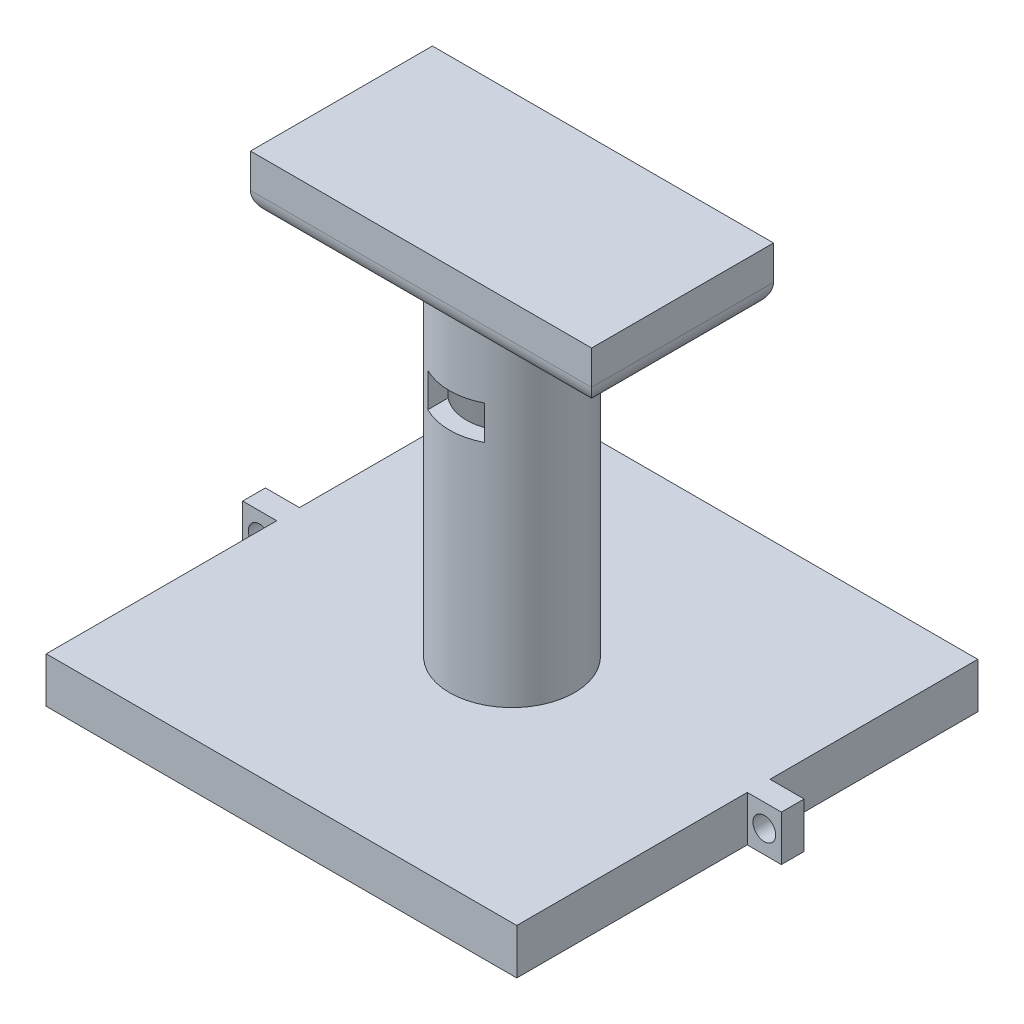
ISO-10303-21;
HEADER;
FILE_DESCRIPTION(('STEP AP214'),'2;1');
FILE_NAME('part.step','',(''),(''),'','','');
FILE_SCHEMA(('AUTOMOTIVE_DESIGN { 1 0 10303 214 1 1 1 1 }'));
ENDSEC;
DATA;
#1=APPLICATION_CONTEXT('core data for automotive mechanical design processes');
#2=APPLICATION_PROTOCOL_DEFINITION('international standard','automotive_design',2000,#1);
#3=PRODUCT_CONTEXT('',#1,'mechanical');
#4=PRODUCT('Part','Part','',(#3));
#5=PRODUCT_RELATED_PRODUCT_CATEGORY('part','',(#4));
#6=PRODUCT_DEFINITION_FORMATION('','',#4);
#7=PRODUCT_DEFINITION_CONTEXT('part definition',#1,'design');
#8=PRODUCT_DEFINITION('design','',#6,#7);
#9=PRODUCT_DEFINITION_SHAPE('','',#8);
#10=(LENGTH_UNIT() NAMED_UNIT(*) SI_UNIT(.MILLI.,.METRE.));
#11=(NAMED_UNIT(*) PLANE_ANGLE_UNIT() SI_UNIT($,.RADIAN.));
#12=(NAMED_UNIT(*) SI_UNIT($,.STERADIAN.) SOLID_ANGLE_UNIT());
#13=UNCERTAINTY_MEASURE_WITH_UNIT(LENGTH_MEASURE(1.E-05),#10,'distance_accuracy_value','');
#14=(GEOMETRIC_REPRESENTATION_CONTEXT(3) GLOBAL_UNCERTAINTY_ASSIGNED_CONTEXT((#13)) GLOBAL_UNIT_ASSIGNED_CONTEXT((#10,
#11,#12)) REPRESENTATION_CONTEXT('',''));
#15=CARTESIAN_POINT('',(0.,0.,0.));
#16=DIRECTION('',(0.,0.,1.));
#17=DIRECTION('',(1.,0.,0.));
#18=AXIS2_PLACEMENT_3D('',#15,#16,#17);
#19=CARTESIAN_POINT('',(0.,3.1496,0.));
#20=DIRECTION('',(0.,1.,0.));
#21=DIRECTION('',(0.,0.,1.));
#22=AXIS2_PLACEMENT_3D('',#19,#20,#21);
#23=CYLINDRICAL_SURFACE('',#22,5.08);
#24=CARTESIAN_POINT('',(0.,43.18,0.));
#25=DIRECTION('',(0.,1.,0.));
#26=DIRECTION('',(0.,0.,1.));
#27=AXIS2_PLACEMENT_3D('',#24,#25,#26);
#28=CIRCLE('',#27,5.08);
#29=CARTESIAN_POINT('',(0.,43.18,5.08));
#30=VERTEX_POINT('',#29);
#31=EDGE_CURVE('E465',#30,#30,#28,.T.);
#32=ORIENTED_EDGE('',*,*,#31,.T.);
#33=EDGE_LOOP('',(#32));
#34=FACE_BOUND('',#33,.T.);
#35=CARTESIAN_POINT('',(0.,3.81,0.));
#36=DIRECTION('',(0.,1.,0.));
#37=DIRECTION('',(0.,0.,1.));
#38=AXIS2_PLACEMENT_3D('',#35,#36,#37);
#39=CIRCLE('',#38,5.08);
#40=CARTESIAN_POINT('',(0.,3.81,5.08));
#41=VERTEX_POINT('',#40);
#42=EDGE_CURVE('E280',#41,#41,#39,.T.);
#43=ORIENTED_EDGE('',*,*,#42,.F.);
#44=EDGE_LOOP('',(#43));
#45=FACE_BOUND('',#44,.T.);
#46=CARTESIAN_POINT('',(0.,30.48,0.));
#47=DIRECTION('',(0.,1.,0.));
#48=DIRECTION('',(0.,0.,1.));
#49=AXIS2_PLACEMENT_3D('',#46,#47,#48);
#50=CIRCLE('',#49,5.08);
#51=CARTESIAN_POINT('',(3.175,30.48,3.96557372898297));
#52=VERTEX_POINT('',#51);
#53=CARTESIAN_POINT('',(-3.175,30.48,3.96557372898298));
#54=VERTEX_POINT('',#53);
#55=EDGE_CURVE('E226',#52,#54,#50,.F.);
#56=ORIENTED_EDGE('',*,*,#55,.F.);
#57=DIRECTION('',(0.,1.,0.));
#58=VECTOR('',#57,1.);
#59=CARTESIAN_POINT('',(3.17500000000001,3.1496,3.96557372898297));
#60=LINE('',#59,#58);
#61=CARTESIAN_POINT('',(3.175,34.29,3.96557372898298));
#62=VERTEX_POINT('',#61);
#63=EDGE_CURVE('E502',#62,#52,#60,.F.);
#64=ORIENTED_EDGE('',*,*,#63,.F.);
#65=CARTESIAN_POINT('',(0.,34.29,0.));
#66=DIRECTION('',(0.,-1.,0.));
#67=DIRECTION('',(0.,0.,-1.));
#68=AXIS2_PLACEMENT_3D('',#65,#66,#67);
#69=CIRCLE('',#68,5.08);
#70=CARTESIAN_POINT('',(-3.175,34.29,3.96557372898298));
#71=VERTEX_POINT('',#70);
#72=EDGE_CURVE('E505',#71,#62,#69,.F.);
#73=ORIENTED_EDGE('',*,*,#72,.F.);
#74=DIRECTION('',(0.,1.,0.));
#75=VECTOR('',#74,1.);
#76=CARTESIAN_POINT('',(-3.175,3.1496,3.96557372898298));
#77=LINE('',#76,#75);
#78=EDGE_CURVE('E508',#54,#71,#77,.T.);
#79=ORIENTED_EDGE('',*,*,#78,.F.);
#80=EDGE_LOOP('',(#56,#64,#73,#79));
#81=FACE_BOUND('',#80,.T.);
#82=ADVANCED_FACE('F42',(#34,#45,#81),#23,.F.);
#83=CARTESIAN_POINT('',(0.,43.18,0.));
#84=DIRECTION('',(0.,-1.,0.));
#85=DIRECTION('',(0.,0.,-1.));
#86=AXIS2_PLACEMENT_3D('',#83,#84,#85);
#87=CYLINDRICAL_SURFACE('',#86,6.985);
#88=CARTESIAN_POINT('',(0.,5.08,0.));
#89=DIRECTION('',(0.,1.,0.));
#90=DIRECTION('',(0.,0.,1.));
#91=AXIS2_PLACEMENT_3D('',#88,#89,#90);
#92=CIRCLE('',#91,6.985);
#93=CARTESIAN_POINT('',(0.,5.08,6.985));
#94=VERTEX_POINT('',#93);
#95=EDGE_CURVE('E461',#94,#94,#92,.T.);
#96=ORIENTED_EDGE('',*,*,#95,.T.);
#97=EDGE_LOOP('',(#96));
#98=FACE_BOUND('',#97,.T.);
#99=CARTESIAN_POINT('',(0.,43.18,0.));
#100=DIRECTION('',(0.,1.,0.));
#101=DIRECTION('',(0.,0.,1.));
#102=AXIS2_PLACEMENT_3D('',#99,#100,#101);
#103=CIRCLE('',#102,6.985);
#104=CARTESIAN_POINT('',(0.,43.18,6.985));
#105=VERTEX_POINT('',#104);
#106=EDGE_CURVE('E285',#105,#105,#103,.T.);
#107=ORIENTED_EDGE('',*,*,#106,.F.);
#108=EDGE_LOOP('',(#107));
#109=FACE_BOUND('',#108,.T.);
#110=CARTESIAN_POINT('',(0.,30.48,0.));
#111=DIRECTION('',(0.,1.,0.));
#112=DIRECTION('',(0.,0.,1.));
#113=AXIS2_PLACEMENT_3D('',#110,#111,#112);
#114=CIRCLE('',#113,6.985);
#115=CARTESIAN_POINT('',(-3.175,30.48,6.22170394666927));
#116=VERTEX_POINT('',#115);
#117=CARTESIAN_POINT('',(3.175,30.48,6.22170394666927));
#118=VERTEX_POINT('',#117);
#119=EDGE_CURVE('E11',#116,#118,#114,.T.);
#120=ORIENTED_EDGE('',*,*,#119,.F.);
#121=DIRECTION('',(0.,-1.,0.));
#122=VECTOR('',#121,1.);
#123=CARTESIAN_POINT('',(-3.175,43.18,6.22170394666927));
#124=LINE('',#123,#122);
#125=CARTESIAN_POINT('',(-3.175,34.29,6.22170394666927));
#126=VERTEX_POINT('',#125);
#127=EDGE_CURVE('E212',#126,#116,#124,.T.);
#128=ORIENTED_EDGE('',*,*,#127,.F.);
#129=CARTESIAN_POINT('',(0.,34.29,0.));
#130=DIRECTION('',(0.,-1.,0.));
#131=DIRECTION('',(0.,0.,-1.));
#132=AXIS2_PLACEMENT_3D('',#129,#130,#131);
#133=CIRCLE('',#132,6.985);
#134=CARTESIAN_POINT('',(3.175,34.29,6.22170394666927));
#135=VERTEX_POINT('',#134);
#136=EDGE_CURVE('E218',#135,#126,#133,.T.);
#137=ORIENTED_EDGE('',*,*,#136,.F.);
#138=DIRECTION('',(0.,-1.,0.));
#139=VECTOR('',#138,1.);
#140=CARTESIAN_POINT('',(3.175,43.18,6.22170394666927));
#141=LINE('',#140,#139);
#142=EDGE_CURVE('E51',#118,#135,#141,.F.);
#143=ORIENTED_EDGE('',*,*,#142,.F.);
#144=EDGE_LOOP('',(#120,#128,#137,#143));
#145=FACE_BOUND('',#144,.T.);
#146=ADVANCED_FACE('F231',(#98,#109,#145),#87,.T.);
#147=CARTESIAN_POINT('',(0.,5.08,0.));
#148=DIRECTION('',(0.,0.,-1.));
#149=DIRECTION('',(-1.,0.,0.));
#150=AXIS2_PLACEMENT_3D('',#147,#148,#149);
#151=PLANE('',#150);
#152=CARTESIAN_POINT('',(28.1803602,2.54,0.));
#153=DIRECTION('',(0.,0.,1.));
#154=DIRECTION('',(1.,0.,0.));
#155=AXIS2_PLACEMENT_3D('',#152,#153,#154);
#156=CIRCLE('',#155,1.27);
#157=CARTESIAN_POINT('',(29.4503602,2.54,0.));
#158=VERTEX_POINT('',#157);
#159=EDGE_CURVE('E284',#158,#158,#156,.T.);
#160=ORIENTED_EDGE('',*,*,#159,.F.);
#161=EDGE_LOOP('',(#160));
#162=FACE_BOUND('',#161,.T.);
#163=DIRECTION('',(1.,0.,0.));
#164=VECTOR('',#163,1.);
#165=CARTESIAN_POINT('',(0.,0.,0.));
#166=LINE('',#165,#164);
#167=CARTESIAN_POINT('',(26.2753602,0.,0.));
#168=VERTEX_POINT('',#167);
#169=CARTESIAN_POINT('',(30.0853602,0.,0.));
#170=VERTEX_POINT('',#169);
#171=EDGE_CURVE('E372',#168,#170,#166,.T.);
#172=ORIENTED_EDGE('',*,*,#171,.T.);
#173=DIRECTION('',(0.,-1.,0.));
#174=VECTOR('',#173,1.);
#175=CARTESIAN_POINT('',(30.0853602,5.08,0.));
#176=LINE('',#175,#174);
#177=CARTESIAN_POINT('',(30.0853602,5.08,0.));
#178=VERTEX_POINT('',#177);
#179=EDGE_CURVE('E279',#178,#170,#176,.T.);
#180=ORIENTED_EDGE('',*,*,#179,.F.);
#181=DIRECTION('',(1.,0.,0.));
#182=VECTOR('',#181,1.);
#183=CARTESIAN_POINT('',(0.,5.08,0.));
#184=LINE('',#183,#182);
#185=CARTESIAN_POINT('',(26.2753602,5.08,0.));
#186=VERTEX_POINT('',#185);
#187=EDGE_CURVE('E409',#186,#178,#184,.T.);
#188=ORIENTED_EDGE('',*,*,#187,.F.);
#189=DIRECTION('',(0.,-1.,0.));
#190=VECTOR('',#189,1.);
#191=CARTESIAN_POINT('',(26.2753602,5.08,0.));
#192=LINE('',#191,#190);
#193=EDGE_CURVE('E332',#186,#168,#192,.T.);
#194=ORIENTED_EDGE('',*,*,#193,.T.);
#195=EDGE_LOOP('',(#172,#180,#188,#194));
#196=FACE_BOUND('',#195,.T.);
#197=ADVANCED_FACE('F540',(#162,#196),#151,.F.);
#198=CARTESIAN_POINT('',(30.0853602,5.08,0.));
#199=DIRECTION('',(-1.,0.,0.));
#200=DIRECTION('',(0.,0.,1.));
#201=AXIS2_PLACEMENT_3D('',#198,#199,#200);
#202=PLANE('',#201);
#203=DIRECTION('',(0.,0.,-1.));
#204=VECTOR('',#203,1.);
#205=CARTESIAN_POINT('',(30.0853602,0.,0.));
#206=LINE('',#205,#204);
#207=CARTESIAN_POINT('',(30.0853602,0.,-2.54));
#208=VERTEX_POINT('',#207);
#209=EDGE_CURVE('E368',#170,#208,#206,.T.);
#210=ORIENTED_EDGE('',*,*,#209,.T.);
#211=DIRECTION('',(0.,-1.,0.));
#212=VECTOR('',#211,1.);
#213=CARTESIAN_POINT('',(30.0853602,5.08,-2.54));
#214=LINE('',#213,#212);
#215=CARTESIAN_POINT('',(30.0853602,5.08,-2.54));
#216=VERTEX_POINT('',#215);
#217=EDGE_CURVE('E299',#216,#208,#214,.T.);
#218=ORIENTED_EDGE('',*,*,#217,.F.);
#219=DIRECTION('',(0.,0.,-1.));
#220=VECTOR('',#219,1.);
#221=CARTESIAN_POINT('',(30.0853602,5.08,0.));
#222=LINE('',#221,#220);
#223=EDGE_CURVE('E406',#178,#216,#222,.T.);
#224=ORIENTED_EDGE('',*,*,#223,.F.);
#225=ORIENTED_EDGE('',*,*,#179,.T.);
#226=EDGE_LOOP('',(#210,#218,#224,#225));
#227=FACE_BOUND('',#226,.T.);
#228=ADVANCED_FACE('F616',(#227),#202,.F.);
#229=CARTESIAN_POINT('',(0.,5.08,-2.54));
#230=DIRECTION('',(0.,0.,-1.));
#231=DIRECTION('',(-1.,0.,0.));
#232=AXIS2_PLACEMENT_3D('',#229,#230,#231);
#233=PLANE('',#232);
#234=CARTESIAN_POINT('',(28.1803602,2.54,-2.54));
#235=DIRECTION('',(0.,0.,-1.));
#236=DIRECTION('',(-1.,0.,0.));
#237=AXIS2_PLACEMENT_3D('',#234,#235,#236);
#238=CIRCLE('',#237,1.27);
#239=CARTESIAN_POINT('',(26.9103602,2.54,-2.54));
#240=VERTEX_POINT('',#239);
#241=EDGE_CURVE('E286',#240,#240,#238,.T.);
#242=ORIENTED_EDGE('',*,*,#241,.F.);
#243=EDGE_LOOP('',(#242));
#244=FACE_BOUND('',#243,.T.);
#245=DIRECTION('',(1.,0.,0.));
#246=VECTOR('',#245,1.);
#247=CARTESIAN_POINT('',(0.,0.,-2.54));
#248=LINE('',#247,#246);
#249=CARTESIAN_POINT('',(26.2753602,0.,-2.54));
#250=VERTEX_POINT('',#249);
#251=EDGE_CURVE('E364',#250,#208,#248,.T.);
#252=ORIENTED_EDGE('',*,*,#251,.F.);
#253=DIRECTION('',(0.,-1.,0.));
#254=VECTOR('',#253,1.);
#255=CARTESIAN_POINT('',(26.2753602,5.08,-2.54));
#256=LINE('',#255,#254);
#257=CARTESIAN_POINT('',(26.2753602,5.08,-2.54));
#258=VERTEX_POINT('',#257);
#259=EDGE_CURVE('E302',#258,#250,#256,.T.);
#260=ORIENTED_EDGE('',*,*,#259,.F.);
#261=DIRECTION('',(1.,0.,0.));
#262=VECTOR('',#261,1.);
#263=CARTESIAN_POINT('',(0.,5.08,-2.54));
#264=LINE('',#263,#262);
#265=EDGE_CURVE('E402',#258,#216,#264,.T.);
#266=ORIENTED_EDGE('',*,*,#265,.T.);
#267=ORIENTED_EDGE('',*,*,#217,.T.);
#268=EDGE_LOOP('',(#252,#260,#266,#267));
#269=FACE_BOUND('',#268,.T.);
#270=ADVANCED_FACE('F613',(#244,#269),#233,.T.);
#271=CARTESIAN_POINT('',(26.2753602,5.08,0.));
#272=DIRECTION('',(1.,0.,0.));
#273=DIRECTION('',(0.,0.,-1.));
#274=AXIS2_PLACEMENT_3D('',#271,#272,#273);
#275=PLANE('',#274);
#276=DIRECTION('',(0.,0.,1.));
#277=VECTOR('',#276,1.);
#278=CARTESIAN_POINT('',(26.2753602,0.,0.));
#279=LINE('',#278,#277);
#280=CARTESIAN_POINT('',(26.2753602,0.,-25.74299652));
#281=VERTEX_POINT('',#280);
#282=EDGE_CURVE('E360',#281,#250,#279,.T.);
#283=ORIENTED_EDGE('',*,*,#282,.F.);
#284=DIRECTION('',(0.,-1.,0.));
#285=VECTOR('',#284,1.);
#286=CARTESIAN_POINT('',(26.2753602,5.08,-25.74299652));
#287=LINE('',#286,#285);
#288=CARTESIAN_POINT('',(26.2753602,5.08,-25.74299652));
#289=VERTEX_POINT('',#288);
#290=EDGE_CURVE('E305',#289,#281,#287,.T.);
#291=ORIENTED_EDGE('',*,*,#290,.F.);
#292=DIRECTION('',(0.,0.,1.));
#293=VECTOR('',#292,1.);
#294=CARTESIAN_POINT('',(26.2753602,5.08,0.));
#295=LINE('',#294,#293);
#296=EDGE_CURVE('E398',#289,#258,#295,.T.);
#297=ORIENTED_EDGE('',*,*,#296,.T.);
#298=ORIENTED_EDGE('',*,*,#259,.T.);
#299=EDGE_LOOP('',(#283,#291,#297,#298));
#300=FACE_BOUND('',#299,.T.);
#301=ADVANCED_FACE('F588',(#300),#275,.T.);
#302=CARTESIAN_POINT('',(0.,5.08,-25.74299652));
#303=DIRECTION('',(0.,0.,-1.));
#304=DIRECTION('',(-1.,0.,0.));
#305=AXIS2_PLACEMENT_3D('',#302,#303,#304);
#306=PLANE('',#305);
#307=DIRECTION('',(1.,0.,0.));
#308=VECTOR('',#307,1.);
#309=CARTESIAN_POINT('',(0.,0.,-25.74299652));
#310=LINE('',#309,#308);
#311=CARTESIAN_POINT('',(-26.2753602,0.,-25.74299652));
#312=VERTEX_POINT('',#311);
#313=EDGE_CURVE('E356',#312,#281,#310,.T.);
#314=ORIENTED_EDGE('',*,*,#313,.F.);
#315=DIRECTION('',(0.,-1.,0.));
#316=VECTOR('',#315,1.);
#317=CARTESIAN_POINT('',(-26.2753602,5.08,-25.74299652));
#318=LINE('',#317,#316);
#319=CARTESIAN_POINT('',(-26.2753602,5.08,-25.74299652));
#320=VERTEX_POINT('',#319);
#321=EDGE_CURVE('E308',#320,#312,#318,.T.);
#322=ORIENTED_EDGE('',*,*,#321,.F.);
#323=DIRECTION('',(1.,0.,0.));
#324=VECTOR('',#323,1.);
#325=CARTESIAN_POINT('',(0.,5.08,-25.74299652));
#326=LINE('',#325,#324);
#327=EDGE_CURVE('E394',#320,#289,#326,.T.);
#328=ORIENTED_EDGE('',*,*,#327,.T.);
#329=ORIENTED_EDGE('',*,*,#290,.T.);
#330=EDGE_LOOP('',(#314,#322,#328,#329));
#331=FACE_BOUND('',#330,.T.);
#332=ADVANCED_FACE('F609',(#331),#306,.T.);
#333=CARTESIAN_POINT('',(-26.2753602,5.08,0.));
#334=DIRECTION('',(1.,0.,0.));
#335=DIRECTION('',(0.,0.,-1.));
#336=AXIS2_PLACEMENT_3D('',#333,#334,#335);
#337=PLANE('',#336);
#338=DIRECTION('',(0.,0.,1.));
#339=VECTOR('',#338,1.);
#340=CARTESIAN_POINT('',(-26.2753602,0.,0.));
#341=LINE('',#340,#339);
#342=CARTESIAN_POINT('',(-26.2753602,0.,-2.54001270000001));
#343=VERTEX_POINT('',#342);
#344=EDGE_CURVE('E353',#312,#343,#341,.T.);
#345=ORIENTED_EDGE('',*,*,#344,.T.);
#346=DIRECTION('',(0.,-1.,0.));
#347=VECTOR('',#346,1.);
#348=CARTESIAN_POINT('',(-26.2753602,5.08,-2.54001270000001));
#349=LINE('',#348,#347);
#350=CARTESIAN_POINT('',(-26.2753602,5.08,-2.54001270000001));
#351=VERTEX_POINT('',#350);
#352=EDGE_CURVE('E311',#351,#343,#349,.T.);
#353=ORIENTED_EDGE('',*,*,#352,.F.);
#354=DIRECTION('',(0.,0.,1.));
#355=VECTOR('',#354,1.);
#356=CARTESIAN_POINT('',(-26.2753602,5.08,0.));
#357=LINE('',#356,#355);
#358=EDGE_CURVE('E391',#320,#351,#357,.T.);
#359=ORIENTED_EDGE('',*,*,#358,.F.);
#360=ORIENTED_EDGE('',*,*,#321,.T.);
#361=EDGE_LOOP('',(#345,#353,#359,#360));
#362=FACE_BOUND('',#361,.T.);
#363=ADVANCED_FACE('F597',(#362),#337,.F.);
#364=CARTESIAN_POINT('',(0.,5.08,-2.54001270000002));
#365=DIRECTION('',(0.,0.,1.));
#366=DIRECTION('',(1.,0.,0.));
#367=AXIS2_PLACEMENT_3D('',#364,#365,#366);
#368=PLANE('',#367);
#369=CARTESIAN_POINT('',(-28.1803602,2.54,-2.54001270000001));
#370=DIRECTION('',(0.,0.,1.));
#371=DIRECTION('',(1.,0.,0.));
#372=AXIS2_PLACEMENT_3D('',#369,#370,#371);
#373=CIRCLE('',#372,1.27);
#374=CARTESIAN_POINT('',(-26.9103602,2.54,-2.54001270000001));
#375=VERTEX_POINT('',#374);
#376=EDGE_CURVE('E291',#375,#375,#373,.T.);
#377=ORIENTED_EDGE('',*,*,#376,.T.);
#378=EDGE_LOOP('',(#377));
#379=FACE_BOUND('',#378,.T.);
#380=DIRECTION('',(-1.,0.,0.));
#381=VECTOR('',#380,1.);
#382=CARTESIAN_POINT('',(0.,0.,-2.54001270000002));
#383=LINE('',#382,#381);
#384=CARTESIAN_POINT('',(-30.0853602,0.,-2.54001270000001));
#385=VERTEX_POINT('',#384);
#386=EDGE_CURVE('E350',#343,#385,#383,.T.);
#387=ORIENTED_EDGE('',*,*,#386,.T.);
#388=DIRECTION('',(0.,-1.,0.));
#389=VECTOR('',#388,1.);
#390=CARTESIAN_POINT('',(-30.0853602,5.08,-2.54001270000001));
#391=LINE('',#390,#389);
#392=CARTESIAN_POINT('',(-30.0853602,5.08,-2.54001270000001));
#393=VERTEX_POINT('',#392);
#394=EDGE_CURVE('E315',#393,#385,#391,.T.);
#395=ORIENTED_EDGE('',*,*,#394,.F.);
#396=DIRECTION('',(-1.,0.,0.));
#397=VECTOR('',#396,1.);
#398=CARTESIAN_POINT('',(0.,5.08,-2.54001270000002));
#399=LINE('',#398,#397);
#400=EDGE_CURVE('E388',#351,#393,#399,.T.);
#401=ORIENTED_EDGE('',*,*,#400,.F.);
#402=ORIENTED_EDGE('',*,*,#352,.T.);
#403=EDGE_LOOP('',(#387,#395,#401,#402));
#404=FACE_BOUND('',#403,.T.);
#405=ADVANCED_FACE('F604',(#379,#404),#368,.F.);
#406=CARTESIAN_POINT('',(-30.0853602,5.08,0.));
#407=DIRECTION('',(1.,0.,0.));
#408=DIRECTION('',(0.,0.,-1.));
#409=AXIS2_PLACEMENT_3D('',#406,#407,#408);
#410=PLANE('',#409);
#411=DIRECTION('',(0.,0.,1.));
#412=VECTOR('',#411,1.);
#413=CARTESIAN_POINT('',(-30.0853602,0.,0.));
#414=LINE('',#413,#412);
#415=CARTESIAN_POINT('',(-30.0853602,0.,-1.27000000052969E-05));
#416=VERTEX_POINT('',#415);
#417=EDGE_CURVE('E346',#385,#416,#414,.T.);
#418=ORIENTED_EDGE('',*,*,#417,.T.);
#419=DIRECTION('',(0.,-1.,0.));
#420=VECTOR('',#419,1.);
#421=CARTESIAN_POINT('',(-30.0853602,5.08,-1.27000000052969E-05));
#422=LINE('',#421,#420);
#423=CARTESIAN_POINT('',(-30.0853602,5.08,-1.27000000052969E-05));
#424=VERTEX_POINT('',#423);
#425=EDGE_CURVE('E319',#424,#416,#422,.T.);
#426=ORIENTED_EDGE('',*,*,#425,.F.);
#427=DIRECTION('',(0.,0.,1.));
#428=VECTOR('',#427,1.);
#429=CARTESIAN_POINT('',(-30.0853602,5.08,0.));
#430=LINE('',#429,#428);
#431=EDGE_CURVE('E385',#393,#424,#430,.T.);
#432=ORIENTED_EDGE('',*,*,#431,.F.);
#433=ORIENTED_EDGE('',*,*,#394,.T.);
#434=EDGE_LOOP('',(#418,#426,#432,#433));
#435=FACE_BOUND('',#434,.T.);
#436=ADVANCED_FACE('F600',(#435),#410,.F.);
#437=CARTESIAN_POINT('',(0.,5.08,-1.26999999876622E-05));
#438=DIRECTION('',(0.,0.,1.));
#439=DIRECTION('',(1.,0.,0.));
#440=AXIS2_PLACEMENT_3D('',#437,#438,#439);
#441=PLANE('',#440);
#442=CARTESIAN_POINT('',(-28.1803602,2.54,-1.27000000043308E-05));
#443=DIRECTION('',(0.,0.,1.));
#444=DIRECTION('',(1.,0.,0.));
#445=AXIS2_PLACEMENT_3D('',#442,#443,#444);
#446=CIRCLE('',#445,1.27);
#447=CARTESIAN_POINT('',(-26.9103602,2.54,-1.27000000035864E-05));
#448=VERTEX_POINT('',#447);
#449=EDGE_CURVE('E292',#448,#448,#446,.T.);
#450=ORIENTED_EDGE('',*,*,#449,.F.);
#451=EDGE_LOOP('',(#450));
#452=FACE_BOUND('',#451,.T.);
#453=DIRECTION('',(-1.,0.,0.));
#454=VECTOR('',#453,1.);
#455=CARTESIAN_POINT('',(0.,0.,-1.26999999876622E-05));
#456=LINE('',#455,#454);
#457=CARTESIAN_POINT('',(-26.2753602,0.,-1.27000000030636E-05));
#458=VERTEX_POINT('',#457);
#459=EDGE_CURVE('E342',#458,#416,#456,.T.);
#460=ORIENTED_EDGE('',*,*,#459,.F.);
#461=DIRECTION('',(0.,-1.,0.));
#462=VECTOR('',#461,1.);
#463=CARTESIAN_POINT('',(-26.2753602,5.08,-1.27000000030636E-05));
#464=LINE('',#463,#462);
#465=CARTESIAN_POINT('',(-26.2753602,5.08,-1.27000000030636E-05));
#466=VERTEX_POINT('',#465);
#467=EDGE_CURVE('E322',#466,#458,#464,.T.);
#468=ORIENTED_EDGE('',*,*,#467,.F.);
#469=DIRECTION('',(-1.,0.,0.));
#470=VECTOR('',#469,1.);
#471=CARTESIAN_POINT('',(0.,5.08,-1.26999999876622E-05));
#472=LINE('',#471,#470);
#473=EDGE_CURVE('E381',#466,#424,#472,.T.);
#474=ORIENTED_EDGE('',*,*,#473,.T.);
#475=ORIENTED_EDGE('',*,*,#425,.T.);
#476=EDGE_LOOP('',(#460,#468,#474,#475));
#477=FACE_BOUND('',#476,.T.);
#478=ADVANCED_FACE('F595',(#452,#477),#441,.T.);
#479=CARTESIAN_POINT('',(-26.2753602,0.,25.7429889));
#480=VERTEX_POINT('',#479);
#481=EDGE_CURVE('E341',#458,#480,#341,.T.);
#482=ORIENTED_EDGE('',*,*,#481,.T.);
#483=DIRECTION('',(0.,-1.,0.));
#484=VECTOR('',#483,1.);
#485=CARTESIAN_POINT('',(-26.2753602,5.08,25.7429889));
#486=LINE('',#485,#484);
#487=CARTESIAN_POINT('',(-26.2753602,5.08,25.7429889));
#488=VERTEX_POINT('',#487);
#489=EDGE_CURVE('E325',#488,#480,#486,.T.);
#490=ORIENTED_EDGE('',*,*,#489,.F.);
#491=EDGE_CURVE('E380',#466,#488,#357,.T.);
#492=ORIENTED_EDGE('',*,*,#491,.F.);
#493=ORIENTED_EDGE('',*,*,#467,.T.);
#494=EDGE_LOOP('',(#482,#490,#492,#493));
#495=FACE_BOUND('',#494,.T.);
#496=ADVANCED_FACE('F591',(#495),#337,.F.);
#497=CARTESIAN_POINT('',(0.,5.08,25.7429889));
#498=DIRECTION('',(0.,0.,-1.));
#499=DIRECTION('',(-1.,0.,0.));
#500=AXIS2_PLACEMENT_3D('',#497,#498,#499);
#501=PLANE('',#500);
#502=DIRECTION('',(1.,0.,0.));
#503=VECTOR('',#502,1.);
#504=CARTESIAN_POINT('',(0.,0.,25.7429889));
#505=LINE('',#504,#503);
#506=CARTESIAN_POINT('',(26.2753602,0.,25.7429889));
#507=VERTEX_POINT('',#506);
#508=EDGE_CURVE('E336',#480,#507,#505,.T.);
#509=ORIENTED_EDGE('',*,*,#508,.T.);
#510=DIRECTION('',(0.,-1.,0.));
#511=VECTOR('',#510,1.);
#512=CARTESIAN_POINT('',(26.2753602,5.08,25.7429889));
#513=LINE('',#512,#511);
#514=CARTESIAN_POINT('',(26.2753602,5.08,25.7429889));
#515=VERTEX_POINT('',#514);
#516=EDGE_CURVE('E329',#515,#507,#513,.T.);
#517=ORIENTED_EDGE('',*,*,#516,.F.);
#518=DIRECTION('',(1.,0.,0.));
#519=VECTOR('',#518,1.);
#520=CARTESIAN_POINT('',(0.,5.08,25.7429889));
#521=LINE('',#520,#519);
#522=EDGE_CURVE('E377',#488,#515,#521,.T.);
#523=ORIENTED_EDGE('',*,*,#522,.F.);
#524=ORIENTED_EDGE('',*,*,#489,.T.);
#525=EDGE_LOOP('',(#509,#517,#523,#524));
#526=FACE_BOUND('',#525,.T.);
#527=ADVANCED_FACE('F586',(#526),#501,.F.);
#528=EDGE_CURVE('E340',#168,#507,#279,.T.);
#529=ORIENTED_EDGE('',*,*,#528,.F.);
#530=ORIENTED_EDGE('',*,*,#193,.F.);
#531=EDGE_CURVE('E335',#186,#515,#295,.T.);
#532=ORIENTED_EDGE('',*,*,#531,.T.);
#533=ORIENTED_EDGE('',*,*,#516,.T.);
#534=EDGE_LOOP('',(#529,#530,#532,#533));
#535=FACE_BOUND('',#534,.T.);
#536=ADVANCED_FACE('F579',(#535),#275,.T.);
#537=CARTESIAN_POINT('',(0.,5.08,0.));
#538=DIRECTION('',(0.,1.,0.));
#539=DIRECTION('',(0.,0.,1.));
#540=AXIS2_PLACEMENT_3D('',#537,#538,#539);
#541=PLANE('',#540);
#542=ORIENTED_EDGE('',*,*,#95,.F.);
#543=EDGE_LOOP('',(#542));
#544=FACE_BOUND('',#543,.T.);
#545=ORIENTED_EDGE('',*,*,#187,.T.);
#546=ORIENTED_EDGE('',*,*,#223,.T.);
#547=ORIENTED_EDGE('',*,*,#265,.F.);
#548=ORIENTED_EDGE('',*,*,#296,.F.);
#549=ORIENTED_EDGE('',*,*,#327,.F.);
#550=ORIENTED_EDGE('',*,*,#358,.T.);
#551=ORIENTED_EDGE('',*,*,#400,.T.);
#552=ORIENTED_EDGE('',*,*,#431,.T.);
#553=ORIENTED_EDGE('',*,*,#473,.F.);
#554=ORIENTED_EDGE('',*,*,#491,.T.);
#555=ORIENTED_EDGE('',*,*,#522,.T.);
#556=ORIENTED_EDGE('',*,*,#531,.F.);
#557=EDGE_LOOP('',(#545,#546,#547,#548,#549,#550,#551,#552,#553,#554,#555,#556));
#558=FACE_BOUND('',#557,.T.);
#559=ADVANCED_FACE('F576',(#544,#558),#541,.T.);
#560=CARTESIAN_POINT('',(0.,0.,0.));
#561=DIRECTION('',(0.,1.,0.));
#562=DIRECTION('',(0.,0.,1.));
#563=AXIS2_PLACEMENT_3D('',#560,#561,#562);
#564=PLANE('',#563);
#565=DIRECTION('',(0.,0.,1.));
#566=VECTOR('',#565,1.);
#567=CARTESIAN_POINT('',(23.7353602,0.,-23.20299652));
#568=LINE('',#567,#566);
#569=CARTESIAN_POINT('',(23.7353602,0.,-23.20299652));
#570=VERTEX_POINT('',#569);
#571=CARTESIAN_POINT('',(23.7353602,0.,23.2029889));
#572=VERTEX_POINT('',#571);
#573=EDGE_CURVE('E435',#570,#572,#568,.T.);
#574=ORIENTED_EDGE('',*,*,#573,.F.);
#575=DIRECTION('',(1.,0.,0.));
#576=VECTOR('',#575,1.);
#577=CARTESIAN_POINT('',(23.7353602,0.,-23.20299652));
#578=LINE('',#577,#576);
#579=CARTESIAN_POINT('',(-23.7353602,0.,-23.20299652));
#580=VERTEX_POINT('',#579);
#581=EDGE_CURVE('E290',#580,#570,#578,.T.);
#582=ORIENTED_EDGE('',*,*,#581,.F.);
#583=DIRECTION('',(0.,0.,-1.));
#584=VECTOR('',#583,1.);
#585=CARTESIAN_POINT('',(-23.7353602,0.,-23.20299652));
#586=LINE('',#585,#584);
#587=CARTESIAN_POINT('',(-23.7353602,0.,23.2029889));
#588=VERTEX_POINT('',#587);
#589=EDGE_CURVE('E426',#588,#580,#586,.T.);
#590=ORIENTED_EDGE('',*,*,#589,.F.);
#591=DIRECTION('',(-1.,0.,0.));
#592=VECTOR('',#591,1.);
#593=CARTESIAN_POINT('',(23.7353602,0.,23.2029889));
#594=LINE('',#593,#592);
#595=EDGE_CURVE('E431',#572,#588,#594,.T.);
#596=ORIENTED_EDGE('',*,*,#595,.F.);
#597=EDGE_LOOP('',(#574,#582,#590,#596));
#598=FACE_BOUND('',#597,.T.);
#599=ORIENTED_EDGE('',*,*,#171,.F.);
#600=ORIENTED_EDGE('',*,*,#528,.T.);
#601=ORIENTED_EDGE('',*,*,#508,.F.);
#602=ORIENTED_EDGE('',*,*,#481,.F.);
#603=ORIENTED_EDGE('',*,*,#459,.T.);
#604=ORIENTED_EDGE('',*,*,#417,.F.);
#605=ORIENTED_EDGE('',*,*,#386,.F.);
#606=ORIENTED_EDGE('',*,*,#344,.F.);
#607=ORIENTED_EDGE('',*,*,#313,.T.);
#608=ORIENTED_EDGE('',*,*,#282,.T.);
#609=ORIENTED_EDGE('',*,*,#251,.T.);
#610=ORIENTED_EDGE('',*,*,#209,.F.);
#611=EDGE_LOOP('',(#599,#600,#601,#602,#603,#604,#605,#606,#607,#608,#609,#610));
#612=FACE_BOUND('',#611,.T.);
#613=ADVANCED_FACE('F574',(#598,#612),#564,.F.);
#614=CARTESIAN_POINT('',(23.7353602,3.81,-23.20299652));
#615=DIRECTION('',(0.,0.,-1.));
#616=DIRECTION('',(-1.,0.,0.));
#617=AXIS2_PLACEMENT_3D('',#614,#615,#616);
#618=PLANE('',#617);
#619=ORIENTED_EDGE('',*,*,#581,.T.);
#620=DIRECTION('',(0.,-1.,0.));
#621=VECTOR('',#620,1.);
#622=CARTESIAN_POINT('',(23.7353602,3.81,-23.20299652));
#623=LINE('',#622,#621);
#624=CARTESIAN_POINT('',(23.7353602,3.81,-23.20299652));
#625=VERTEX_POINT('',#624);
#626=EDGE_CURVE('E413',#625,#570,#623,.T.);
#627=ORIENTED_EDGE('',*,*,#626,.F.);
#628=DIRECTION('',(1.,0.,0.));
#629=VECTOR('',#628,1.);
#630=CARTESIAN_POINT('',(23.7353602,3.81,-23.20299652));
#631=LINE('',#630,#629);
#632=CARTESIAN_POINT('',(-23.7353602,3.81,-23.20299652));
#633=VERTEX_POINT('',#632);
#634=EDGE_CURVE('E430',#633,#625,#631,.T.);
#635=ORIENTED_EDGE('',*,*,#634,.F.);
#636=DIRECTION('',(0.,-1.,0.));
#637=VECTOR('',#636,1.);
#638=CARTESIAN_POINT('',(-23.7353602,3.81,-23.20299652));
#639=LINE('',#638,#637);
#640=EDGE_CURVE('E376',#633,#580,#639,.T.);
#641=ORIENTED_EDGE('',*,*,#640,.T.);
#642=EDGE_LOOP('',(#619,#627,#635,#641));
#643=FACE_BOUND('',#642,.T.);
#644=ADVANCED_FACE('F564',(#643),#618,.F.);
#645=CARTESIAN_POINT('',(-23.7353602,3.81,-23.20299652));
#646=DIRECTION('',(-1.,0.,0.));
#647=DIRECTION('',(0.,0.,1.));
#648=AXIS2_PLACEMENT_3D('',#645,#646,#647);
#649=PLANE('',#648);
#650=ORIENTED_EDGE('',*,*,#589,.T.);
#651=ORIENTED_EDGE('',*,*,#640,.F.);
#652=DIRECTION('',(0.,0.,-1.));
#653=VECTOR('',#652,1.);
#654=CARTESIAN_POINT('',(-23.7353602,3.81,-23.20299652));
#655=LINE('',#654,#653);
#656=CARTESIAN_POINT('',(-23.7353602,3.81,23.2029889));
#657=VERTEX_POINT('',#656);
#658=EDGE_CURVE('E418',#657,#633,#655,.T.);
#659=ORIENTED_EDGE('',*,*,#658,.F.);
#660=DIRECTION('',(0.,-1.,0.));
#661=VECTOR('',#660,1.);
#662=CARTESIAN_POINT('',(-23.7353602,3.81,23.2029889));
#663=LINE('',#662,#661);
#664=EDGE_CURVE('E421',#657,#588,#663,.T.);
#665=ORIENTED_EDGE('',*,*,#664,.T.);
#666=EDGE_LOOP('',(#650,#651,#659,#665));
#667=FACE_BOUND('',#666,.T.);
#668=ADVANCED_FACE('F560',(#667),#649,.F.);
#669=CARTESIAN_POINT('',(23.7353602,3.81,23.2029889));
#670=DIRECTION('',(0.,0.,1.));
#671=DIRECTION('',(1.,0.,0.));
#672=AXIS2_PLACEMENT_3D('',#669,#670,#671);
#673=PLANE('',#672);
#674=ORIENTED_EDGE('',*,*,#595,.T.);
#675=ORIENTED_EDGE('',*,*,#664,.F.);
#676=DIRECTION('',(-1.,0.,0.));
#677=VECTOR('',#676,1.);
#678=CARTESIAN_POINT('',(23.7353602,3.81,23.2029889));
#679=LINE('',#678,#677);
#680=CARTESIAN_POINT('',(23.7353602,3.81,23.2029889));
#681=VERTEX_POINT('',#680);
#682=EDGE_CURVE('E444',#681,#657,#679,.T.);
#683=ORIENTED_EDGE('',*,*,#682,.F.);
#684=DIRECTION('',(0.,-1.,0.));
#685=VECTOR('',#684,1.);
#686=CARTESIAN_POINT('',(23.7353602,3.81,23.2029889));
#687=LINE('',#686,#685);
#688=EDGE_CURVE('E417',#681,#572,#687,.T.);
#689=ORIENTED_EDGE('',*,*,#688,.T.);
#690=EDGE_LOOP('',(#674,#675,#683,#689));
#691=FACE_BOUND('',#690,.T.);
#692=ADVANCED_FACE('F563',(#691),#673,.F.);
#693=CARTESIAN_POINT('',(23.7353602,3.81,-23.20299652));
#694=DIRECTION('',(1.,0.,0.));
#695=DIRECTION('',(0.,0.,-1.));
#696=AXIS2_PLACEMENT_3D('',#693,#694,#695);
#697=PLANE('',#696);
#698=ORIENTED_EDGE('',*,*,#573,.T.);
#699=ORIENTED_EDGE('',*,*,#688,.F.);
#700=DIRECTION('',(0.,0.,1.));
#701=VECTOR('',#700,1.);
#702=CARTESIAN_POINT('',(23.7353602,3.81,-23.20299652));
#703=LINE('',#702,#701);
#704=EDGE_CURVE('E448',#625,#681,#703,.T.);
#705=ORIENTED_EDGE('',*,*,#704,.F.);
#706=ORIENTED_EDGE('',*,*,#626,.T.);
#707=EDGE_LOOP('',(#698,#699,#705,#706));
#708=FACE_BOUND('',#707,.T.);
#709=ADVANCED_FACE('F558',(#708),#697,.F.);
#710=CARTESIAN_POINT('',(0.,3.81,0.));
#711=DIRECTION('',(0.,1.,0.));
#712=DIRECTION('',(0.,0.,1.));
#713=AXIS2_PLACEMENT_3D('',#710,#711,#712);
#714=PLANE('',#713);
#715=ORIENTED_EDGE('',*,*,#42,.T.);
#716=EDGE_LOOP('',(#715));
#717=FACE_BOUND('',#716,.T.);
#718=ORIENTED_EDGE('',*,*,#634,.T.);
#719=ORIENTED_EDGE('',*,*,#704,.T.);
#720=ORIENTED_EDGE('',*,*,#682,.T.);
#721=ORIENTED_EDGE('',*,*,#658,.T.);
#722=EDGE_LOOP('',(#718,#719,#720,#721));
#723=FACE_BOUND('',#722,.T.);
#724=ADVANCED_FACE('F554',(#717,#723),#714,.F.);
#725=CARTESIAN_POINT('',(-28.1803602,2.54,-3.302));
#726=DIRECTION('',(0.,0.,1.));
#727=DIRECTION('',(1.,0.,0.));
#728=AXIS2_PLACEMENT_3D('',#725,#726,#727);
#729=CYLINDRICAL_SURFACE('',#728,1.27);
#730=ORIENTED_EDGE('',*,*,#449,.T.);
#731=EDGE_LOOP('',(#730));
#732=FACE_BOUND('',#731,.T.);
#733=ORIENTED_EDGE('',*,*,#376,.F.);
#734=EDGE_LOOP('',(#733));
#735=FACE_BOUND('',#734,.T.);
#736=ADVANCED_FACE('F550',(#732,#735),#729,.F.);
#737=CARTESIAN_POINT('',(28.1803602,2.54,-3.302));
#738=DIRECTION('',(0.,0.,1.));
#739=DIRECTION('',(1.,0.,0.));
#740=AXIS2_PLACEMENT_3D('',#737,#738,#739);
#741=CYLINDRICAL_SURFACE('',#740,1.27);
#742=ORIENTED_EDGE('',*,*,#241,.T.);
#743=EDGE_LOOP('',(#742));
#744=FACE_BOUND('',#743,.T.);
#745=ORIENTED_EDGE('',*,*,#159,.T.);
#746=EDGE_LOOP('',(#745));
#747=FACE_BOUND('',#746,.T.);
#748=ADVANCED_FACE('F546',(#744,#747),#741,.F.);
#749=CARTESIAN_POINT('',(0.,43.18,0.));
#750=DIRECTION('',(0.,-1.,0.));
#751=DIRECTION('',(0.,0.,-1.));
#752=AXIS2_PLACEMENT_3D('',#749,#750,#751);
#753=PLANE('',#752);
#754=DIRECTION('',(-1.,0.,0.));
#755=VECTOR('',#754,1.);
#756=CARTESIAN_POINT('',(19.05,43.18,-7.62));
#757=LINE('',#756,#755);
#758=CARTESIAN_POINT('',(-16.51,43.18,-7.62));
#759=VERTEX_POINT('',#758);
#760=CARTESIAN_POINT('',(16.51,43.18,-7.62));
#761=VERTEX_POINT('',#760);
#762=EDGE_CURVE('E266',#759,#761,#757,.F.);
#763=ORIENTED_EDGE('',*,*,#762,.T.);
#764=DIRECTION('',(0.,0.,-1.));
#765=VECTOR('',#764,1.);
#766=CARTESIAN_POINT('',(16.51,43.18,10.16));
#767=LINE('',#766,#765);
#768=CARTESIAN_POINT('',(16.51,43.18,7.62));
#769=VERTEX_POINT('',#768);
#770=EDGE_CURVE('E262',#761,#769,#767,.F.);
#771=ORIENTED_EDGE('',*,*,#770,.T.);
#772=DIRECTION('',(1.,0.,0.));
#773=VECTOR('',#772,1.);
#774=CARTESIAN_POINT('',(-19.05,43.18,7.62));
#775=LINE('',#774,#773);
#776=CARTESIAN_POINT('',(-16.51,43.18,7.62));
#777=VERTEX_POINT('',#776);
#778=EDGE_CURVE('E272',#769,#777,#775,.F.);
#779=ORIENTED_EDGE('',*,*,#778,.T.);
#780=DIRECTION('',(0.,0.,1.));
#781=VECTOR('',#780,1.);
#782=CARTESIAN_POINT('',(-16.51,43.18,-10.16));
#783=LINE('',#782,#781);
#784=EDGE_CURVE('E269',#777,#759,#783,.F.);
#785=ORIENTED_EDGE('',*,*,#784,.T.);
#786=EDGE_LOOP('',(#763,#771,#779,#785));
#787=FACE_BOUND('',#786,.T.);
#788=ORIENTED_EDGE('',*,*,#106,.T.);
#789=EDGE_LOOP('',(#788));
#790=FACE_BOUND('',#789,.T.);
#791=ADVANCED_FACE('F549',(#787,#790),#753,.T.);
#792=CARTESIAN_POINT('',(0.,49.53,0.));
#793=DIRECTION('',(0.,-1.,0.));
#794=DIRECTION('',(0.,0.,-1.));
#795=AXIS2_PLACEMENT_3D('',#792,#793,#794);
#796=PLANE('',#795);
#797=DIRECTION('',(0.,0.,1.));
#798=VECTOR('',#797,1.);
#799=CARTESIAN_POINT('',(-19.05,49.53,10.16));
#800=LINE('',#799,#798);
#801=CARTESIAN_POINT('',(-19.05,49.53,-10.16));
#802=VERTEX_POINT('',#801);
#803=CARTESIAN_POINT('',(-19.05,49.53,10.16));
#804=VERTEX_POINT('',#803);
#805=EDGE_CURVE('E243',#802,#804,#800,.T.);
#806=ORIENTED_EDGE('',*,*,#805,.T.);
#807=DIRECTION('',(1.,0.,0.));
#808=VECTOR('',#807,1.);
#809=CARTESIAN_POINT('',(-19.05,49.53,10.16));
#810=LINE('',#809,#808);
#811=CARTESIAN_POINT('',(19.05,49.53,10.16));
#812=VERTEX_POINT('',#811);
#813=EDGE_CURVE('E494',#804,#812,#810,.T.);
#814=ORIENTED_EDGE('',*,*,#813,.T.);
#815=DIRECTION('',(0.,0.,-1.));
#816=VECTOR('',#815,1.);
#817=CARTESIAN_POINT('',(19.05,49.53,10.16));
#818=LINE('',#817,#816);
#819=CARTESIAN_POINT('',(19.05,49.53,-10.16));
#820=VERTEX_POINT('',#819);
#821=EDGE_CURVE('E491',#812,#820,#818,.T.);
#822=ORIENTED_EDGE('',*,*,#821,.T.);
#823=DIRECTION('',(-1.,0.,0.));
#824=VECTOR('',#823,1.);
#825=CARTESIAN_POINT('',(-19.05,49.53,-10.16));
#826=LINE('',#825,#824);
#827=EDGE_CURVE('E488',#820,#802,#826,.T.);
#828=ORIENTED_EDGE('',*,*,#827,.T.);
#829=EDGE_LOOP('',(#806,#814,#822,#828));
#830=FACE_BOUND('',#829,.T.);
#831=ADVANCED_FACE('F663',(#830),#796,.F.);
#832=CARTESIAN_POINT('',(-19.05,49.53,-10.16));
#833=DIRECTION('',(0.,0.,1.));
#834=DIRECTION('',(1.,0.,0.));
#835=AXIS2_PLACEMENT_3D('',#832,#833,#834);
#836=PLANE('',#835);
#837=DIRECTION('',(0.,-1.,0.));
#838=VECTOR('',#837,1.);
#839=CARTESIAN_POINT('',(19.05,49.53,-10.16));
#840=LINE('',#839,#838);
#841=CARTESIAN_POINT('',(19.05,45.72,-10.16));
#842=VERTEX_POINT('',#841);
#843=EDGE_CURVE('E480',#820,#842,#840,.T.);
#844=ORIENTED_EDGE('',*,*,#843,.T.);
#845=DIRECTION('',(-1.,0.,0.));
#846=VECTOR('',#845,1.);
#847=CARTESIAN_POINT('',(-19.05,45.72,-10.16));
#848=LINE('',#847,#846);
#849=CARTESIAN_POINT('',(-19.05,45.72,-10.16));
#850=VERTEX_POINT('',#849);
#851=EDGE_CURVE('E259',#842,#850,#848,.T.);
#852=ORIENTED_EDGE('',*,*,#851,.T.);
#853=DIRECTION('',(0.,-1.,0.));
#854=VECTOR('',#853,1.);
#855=CARTESIAN_POINT('',(-19.05,49.53,-10.16));
#856=LINE('',#855,#854);
#857=EDGE_CURVE('E484',#802,#850,#856,.T.);
#858=ORIENTED_EDGE('',*,*,#857,.F.);
#859=ORIENTED_EDGE('',*,*,#827,.F.);
#860=EDGE_LOOP('',(#844,#852,#858,#859));
#861=FACE_BOUND('',#860,.T.);
#862=ADVANCED_FACE('F660',(#861),#836,.F.);
#863=CARTESIAN_POINT('',(19.05,49.53,10.16));
#864=DIRECTION('',(-1.,0.,0.));
#865=DIRECTION('',(0.,0.,1.));
#866=AXIS2_PLACEMENT_3D('',#863,#864,#865);
#867=PLANE('',#866);
#868=DIRECTION('',(0.,-1.,0.));
#869=VECTOR('',#868,1.);
#870=CARTESIAN_POINT('',(19.05,49.53,10.16));
#871=LINE('',#870,#869);
#872=CARTESIAN_POINT('',(19.05,45.72,10.16));
#873=VERTEX_POINT('',#872);
#874=EDGE_CURVE('E476',#812,#873,#871,.T.);
#875=ORIENTED_EDGE('',*,*,#874,.T.);
#876=DIRECTION('',(0.,0.,-1.));
#877=VECTOR('',#876,1.);
#878=CARTESIAN_POINT('',(19.05,45.72,-10.16));
#879=LINE('',#878,#877);
#880=EDGE_CURVE('E275',#873,#842,#879,.T.);
#881=ORIENTED_EDGE('',*,*,#880,.T.);
#882=ORIENTED_EDGE('',*,*,#843,.F.);
#883=ORIENTED_EDGE('',*,*,#821,.F.);
#884=EDGE_LOOP('',(#875,#881,#882,#883));
#885=FACE_BOUND('',#884,.T.);
#886=ADVANCED_FACE('F656',(#885),#867,.F.);
#887=CARTESIAN_POINT('',(-19.05,49.53,10.16));
#888=DIRECTION('',(0.,0.,-1.));
#889=DIRECTION('',(-1.,0.,0.));
#890=AXIS2_PLACEMENT_3D('',#887,#888,#889);
#891=PLANE('',#890);
#892=DIRECTION('',(0.,-1.,0.));
#893=VECTOR('',#892,1.);
#894=CARTESIAN_POINT('',(-19.05,49.53,10.16));
#895=LINE('',#894,#893);
#896=CARTESIAN_POINT('',(-19.05,45.72,10.16));
#897=VERTEX_POINT('',#896);
#898=EDGE_CURVE('E472',#804,#897,#895,.T.);
#899=ORIENTED_EDGE('',*,*,#898,.T.);
#900=DIRECTION('',(1.,0.,0.));
#901=VECTOR('',#900,1.);
#902=CARTESIAN_POINT('',(19.05,45.72,10.16));
#903=LINE('',#902,#901);
#904=EDGE_CURVE('E219',#897,#873,#903,.T.);
#905=ORIENTED_EDGE('',*,*,#904,.T.);
#906=ORIENTED_EDGE('',*,*,#874,.F.);
#907=ORIENTED_EDGE('',*,*,#813,.F.);
#908=EDGE_LOOP('',(#899,#905,#906,#907));
#909=FACE_BOUND('',#908,.T.);
#910=ADVANCED_FACE('F666',(#909),#891,.F.);
#911=CARTESIAN_POINT('',(-19.05,49.53,10.16));
#912=DIRECTION('',(1.,0.,0.));
#913=DIRECTION('',(0.,0.,-1.));
#914=AXIS2_PLACEMENT_3D('',#911,#912,#913);
#915=PLANE('',#914);
#916=ORIENTED_EDGE('',*,*,#857,.T.);
#917=DIRECTION('',(0.,0.,1.));
#918=VECTOR('',#917,1.);
#919=CARTESIAN_POINT('',(-19.05,45.72,10.16));
#920=LINE('',#919,#918);
#921=EDGE_CURVE('E256',#850,#897,#920,.T.);
#922=ORIENTED_EDGE('',*,*,#921,.T.);
#923=ORIENTED_EDGE('',*,*,#898,.F.);
#924=ORIENTED_EDGE('',*,*,#805,.F.);
#925=EDGE_LOOP('',(#916,#922,#923,#924));
#926=FACE_BOUND('',#925,.T.);
#927=ADVANCED_FACE('F668',(#926),#915,.F.);
#928=ORIENTED_EDGE('',*,*,#31,.F.);
#929=EDGE_LOOP('',(#928));
#930=FACE_BOUND('',#929,.T.);
#931=ADVANCED_FACE('F636',(#930),#753,.T.);
#932=CARTESIAN_POINT('',(-16.51,45.72,10.16));
#933=DIRECTION('',(0.,0.,-1.));
#934=DIRECTION('',(-1.,0.,0.));
#935=AXIS2_PLACEMENT_3D('',#932,#933,#934);
#936=CYLINDRICAL_SURFACE('',#935,2.54);
#937=CARTESIAN_POINT('',(-16.51,45.72,-7.62));
#938=DIRECTION('',(0.707106781186547,0.,-0.707106781186548));
#939=DIRECTION('',(-0.707106781186548,0.,-0.707106781186547));
#940=AXIS2_PLACEMENT_3D('',#937,#938,#939);
#941=ELLIPSE('',#940,3.59210244842766,2.54);
#942=EDGE_CURVE('E244',#759,#850,#941,.T.);
#943=ORIENTED_EDGE('',*,*,#942,.F.);
#944=ORIENTED_EDGE('',*,*,#784,.F.);
#945=CARTESIAN_POINT('',(-16.51,45.72,7.62));
#946=DIRECTION('',(-0.707106781186548,0.,-0.707106781186547));
#947=DIRECTION('',(-0.707106781186547,0.,0.707106781186548));
#948=AXIS2_PLACEMENT_3D('',#945,#946,#947);
#949=ELLIPSE('',#948,3.59210244842766,2.54);
#950=EDGE_CURVE('E239',#897,#777,#949,.F.);
#951=ORIENTED_EDGE('',*,*,#950,.F.);
#952=ORIENTED_EDGE('',*,*,#921,.F.);
#953=EDGE_LOOP('',(#943,#944,#951,#952));
#954=FACE_BOUND('',#953,.T.);
#955=ADVANCED_FACE('F44',(#954),#936,.T.);
#956=CARTESIAN_POINT('',(-19.05,45.72,7.62));
#957=DIRECTION('',(-1.,0.,0.));
#958=DIRECTION('',(0.,0.,1.));
#959=AXIS2_PLACEMENT_3D('',#956,#957,#958);
#960=CYLINDRICAL_SURFACE('',#959,2.54);
#961=ORIENTED_EDGE('',*,*,#950,.T.);
#962=ORIENTED_EDGE('',*,*,#778,.F.);
#963=CARTESIAN_POINT('',(16.51,45.72,7.62));
#964=DIRECTION('',(-0.707106781186547,0.,0.707106781186548));
#965=DIRECTION('',(-0.707106781186548,0.,-0.707106781186547));
#966=AXIS2_PLACEMENT_3D('',#963,#964,#965);
#967=ELLIPSE('',#966,3.59210244842766,2.54);
#968=EDGE_CURVE('E248',#873,#769,#967,.F.);
#969=ORIENTED_EDGE('',*,*,#968,.F.);
#970=ORIENTED_EDGE('',*,*,#904,.F.);
#971=EDGE_LOOP('',(#961,#962,#969,#970));
#972=FACE_BOUND('',#971,.T.);
#973=ADVANCED_FACE('F629',(#972),#960,.T.);
#974=CARTESIAN_POINT('',(-19.05,45.72,-7.62));
#975=DIRECTION('',(1.,0.,0.));
#976=DIRECTION('',(0.,0.,-1.));
#977=AXIS2_PLACEMENT_3D('',#974,#975,#976);
#978=CYLINDRICAL_SURFACE('',#977,2.54);
#979=ORIENTED_EDGE('',*,*,#942,.T.);
#980=ORIENTED_EDGE('',*,*,#851,.F.);
#981=CARTESIAN_POINT('',(16.51,45.72,-7.62));
#982=DIRECTION('',(0.707106781186548,0.,0.707106781186547));
#983=DIRECTION('',(0.707106781186547,0.,-0.707106781186548));
#984=AXIS2_PLACEMENT_3D('',#981,#982,#983);
#985=ELLIPSE('',#984,3.59210244842766,2.54);
#986=EDGE_CURVE('E251',#761,#842,#985,.T.);
#987=ORIENTED_EDGE('',*,*,#986,.F.);
#988=ORIENTED_EDGE('',*,*,#762,.F.);
#989=EDGE_LOOP('',(#979,#980,#987,#988));
#990=FACE_BOUND('',#989,.T.);
#991=ADVANCED_FACE('F626',(#990),#978,.T.);
#992=CARTESIAN_POINT('',(16.51,45.72,10.16));
#993=DIRECTION('',(0.,0.,1.));
#994=DIRECTION('',(1.,0.,0.));
#995=AXIS2_PLACEMENT_3D('',#992,#993,#994);
#996=CYLINDRICAL_SURFACE('',#995,2.54);
#997=ORIENTED_EDGE('',*,*,#968,.T.);
#998=ORIENTED_EDGE('',*,*,#770,.F.);
#999=ORIENTED_EDGE('',*,*,#986,.T.);
#1000=ORIENTED_EDGE('',*,*,#880,.F.);
#1001=EDGE_LOOP('',(#997,#998,#999,#1000));
#1002=FACE_BOUND('',#1001,.T.);
#1003=ADVANCED_FACE('F531',(#1002),#996,.T.);
#1004=CARTESIAN_POINT('',(3.175,30.48,12.2809889));
#1005=DIRECTION('',(0.,1.,0.));
#1006=DIRECTION('',(0.,0.,1.));
#1007=AXIS2_PLACEMENT_3D('',#1004,#1005,#1006);
#1008=PLANE('',#1007);
#1009=ORIENTED_EDGE('',*,*,#55,.T.);
#1010=DIRECTION('',(0.,0.,-1.));
#1011=VECTOR('',#1010,1.);
#1012=CARTESIAN_POINT('',(-3.175,30.48,12.2809889));
#1013=LINE('',#1012,#1011);
#1014=EDGE_CURVE('E58',#116,#54,#1013,.T.);
#1015=ORIENTED_EDGE('',*,*,#1014,.F.);
#1016=ORIENTED_EDGE('',*,*,#119,.T.);
#1017=DIRECTION('',(0.,0.,-1.));
#1018=VECTOR('',#1017,1.);
#1019=CARTESIAN_POINT('',(3.175,30.48,12.2809889));
#1020=LINE('',#1019,#1018);
#1021=EDGE_CURVE('E511',#118,#52,#1020,.T.);
#1022=ORIENTED_EDGE('',*,*,#1021,.T.);
#1023=EDGE_LOOP('',(#1009,#1015,#1016,#1022));
#1024=FACE_BOUND('',#1023,.T.);
#1025=ADVANCED_FACE('F222',(#1024),#1008,.T.);
#1026=CARTESIAN_POINT('',(3.175,30.48,12.2809889));
#1027=DIRECTION('',(-1.,0.,0.));
#1028=DIRECTION('',(0.,-1.,0.));
#1029=AXIS2_PLACEMENT_3D('',#1026,#1027,#1028);
#1030=PLANE('',#1029);
#1031=ORIENTED_EDGE('',*,*,#63,.T.);
#1032=ORIENTED_EDGE('',*,*,#1021,.F.);
#1033=ORIENTED_EDGE('',*,*,#142,.T.);
#1034=DIRECTION('',(0.,0.,-1.));
#1035=VECTOR('',#1034,1.);
#1036=CARTESIAN_POINT('',(3.175,34.29,12.2809889));
#1037=LINE('',#1036,#1035);
#1038=EDGE_CURVE('E514',#135,#62,#1037,.T.);
#1039=ORIENTED_EDGE('',*,*,#1038,.T.);
#1040=EDGE_LOOP('',(#1031,#1032,#1033,#1039));
#1041=FACE_BOUND('',#1040,.T.);
#1042=ADVANCED_FACE('F523',(#1041),#1030,.T.);
#1043=CARTESIAN_POINT('',(3.175,34.29,12.2809889));
#1044=DIRECTION('',(0.,-1.,0.));
#1045=DIRECTION('',(0.,0.,-1.));
#1046=AXIS2_PLACEMENT_3D('',#1043,#1044,#1045);
#1047=PLANE('',#1046);
#1048=ORIENTED_EDGE('',*,*,#72,.T.);
#1049=ORIENTED_EDGE('',*,*,#1038,.F.);
#1050=ORIENTED_EDGE('',*,*,#136,.T.);
#1051=DIRECTION('',(0.,0.,-1.));
#1052=VECTOR('',#1051,1.);
#1053=CARTESIAN_POINT('',(-3.175,34.29,12.2809889));
#1054=LINE('',#1053,#1052);
#1055=EDGE_CURVE('E63',#126,#71,#1054,.T.);
#1056=ORIENTED_EDGE('',*,*,#1055,.T.);
#1057=EDGE_LOOP('',(#1048,#1049,#1050,#1056));
#1058=FACE_BOUND('',#1057,.T.);
#1059=ADVANCED_FACE('F520',(#1058),#1047,.T.);
#1060=CARTESIAN_POINT('',(-3.175,30.48,12.2809889));
#1061=DIRECTION('',(1.,0.,0.));
#1062=DIRECTION('',(0.,0.,-1.));
#1063=AXIS2_PLACEMENT_3D('',#1060,#1061,#1062);
#1064=PLANE('',#1063);
#1065=ORIENTED_EDGE('',*,*,#78,.T.);
#1066=ORIENTED_EDGE('',*,*,#1055,.F.);
#1067=ORIENTED_EDGE('',*,*,#127,.T.);
#1068=ORIENTED_EDGE('',*,*,#1014,.T.);
#1069=EDGE_LOOP('',(#1065,#1066,#1067,#1068));
#1070=FACE_BOUND('',#1069,.T.);
#1071=ADVANCED_FACE('F213',(#1070),#1064,.T.);
#1072=CLOSED_SHELL('',(#82,#146,#197,#228,#270,#301,#332,#363,#405,#436,#478,#496,#527,#536,
#559,#613,#644,#668,#692,#709,#724,#736,#748,#791,#831,#862,#886,#910,#927,#931,#955,#973,#991,
#1003,#1025,#1042,#1059,#1071));
#1073=MANIFOLD_SOLID_BREP('B2',#1072);
#1074=ADVANCED_BREP_SHAPE_REPRESENTATION('',(#18,#1073),#14);
#1075=SHAPE_DEFINITION_REPRESENTATION(#9,#1074);
ENDSEC;
END-ISO-10303-21;
